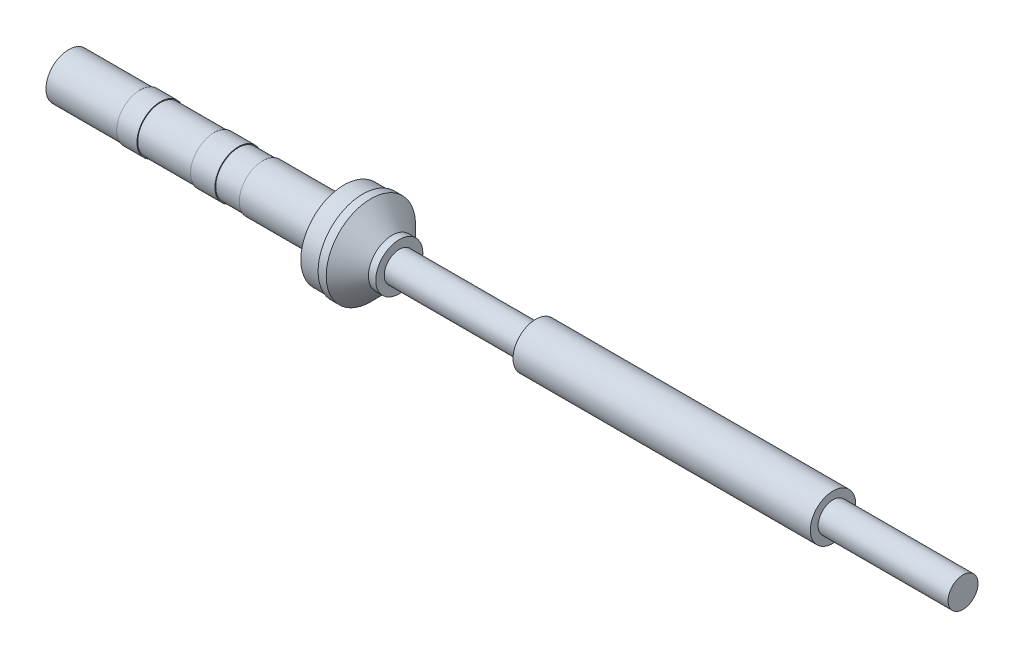
ISO-10303-21;
HEADER;
FILE_DESCRIPTION(('STEP AP214'),'2;1');
FILE_NAME('part.step','',(''),(''),'','','');
FILE_SCHEMA(('AUTOMOTIVE_DESIGN { 1 0 10303 214 1 1 1 1 }'));
ENDSEC;
DATA;
#1=APPLICATION_CONTEXT('core data for automotive mechanical design processes');
#2=APPLICATION_PROTOCOL_DEFINITION('international standard','automotive_design',2000,#1);
#3=PRODUCT_CONTEXT('',#1,'mechanical');
#4=PRODUCT('Part','Part','',(#3));
#5=PRODUCT_RELATED_PRODUCT_CATEGORY('part','',(#4));
#6=PRODUCT_DEFINITION_FORMATION('','',#4);
#7=PRODUCT_DEFINITION_CONTEXT('part definition',#1,'design');
#8=PRODUCT_DEFINITION('design','',#6,#7);
#9=PRODUCT_DEFINITION_SHAPE('','',#8);
#10=(LENGTH_UNIT() NAMED_UNIT(*) SI_UNIT(.MILLI.,.METRE.));
#11=(NAMED_UNIT(*) PLANE_ANGLE_UNIT() SI_UNIT($,.RADIAN.));
#12=(NAMED_UNIT(*) SI_UNIT($,.STERADIAN.) SOLID_ANGLE_UNIT());
#13=UNCERTAINTY_MEASURE_WITH_UNIT(LENGTH_MEASURE(1.E-05),#10,'distance_accuracy_value','');
#14=(GEOMETRIC_REPRESENTATION_CONTEXT(3) GLOBAL_UNCERTAINTY_ASSIGNED_CONTEXT((#13)) GLOBAL_UNIT_ASSIGNED_CONTEXT((#10,
#11,#12)) REPRESENTATION_CONTEXT('',''));
#15=CARTESIAN_POINT('',(0.,0.,0.));
#16=DIRECTION('',(0.,0.,1.));
#17=DIRECTION('',(1.,0.,0.));
#18=AXIS2_PLACEMENT_3D('',#15,#16,#17);
#19=CARTESIAN_POINT('',(28.,0.,0.));
#20=DIRECTION('',(-1.,0.,0.));
#21=DIRECTION('',(0.,0.,1.));
#22=AXIS2_PLACEMENT_3D('',#19,#20,#21);
#23=CYLINDRICAL_SURFACE('',#22,2.79447482898832);
#24=CARTESIAN_POINT('',(28.,0.,0.));
#25=DIRECTION('',(1.,0.,0.));
#26=DIRECTION('',(0.,0.,-1.));
#27=AXIS2_PLACEMENT_3D('',#24,#25,#26);
#28=CIRCLE('',#27,2.79447482898832);
#29=CARTESIAN_POINT('',(28.,0.,-2.79447482898832));
#30=VERTEX_POINT('',#29);
#31=EDGE_CURVE('E11',#30,#30,#28,.T.);
#32=ORIENTED_EDGE('',*,*,#31,.F.);
#33=EDGE_LOOP('',(#32));
#34=FACE_BOUND('',#33,.T.);
#35=CARTESIAN_POINT('',(0.,0.,0.));
#36=DIRECTION('',(1.,0.,0.));
#37=DIRECTION('',(0.,0.,-1.));
#38=AXIS2_PLACEMENT_3D('',#35,#36,#37);
#39=CIRCLE('',#38,2.79447482898832);
#40=CARTESIAN_POINT('',(0.,0.,-2.79447482898832));
#41=VERTEX_POINT('',#40);
#42=EDGE_CURVE('E47',#41,#41,#39,.T.);
#43=ORIENTED_EDGE('',*,*,#42,.T.);
#44=EDGE_LOOP('',(#43));
#45=FACE_BOUND('',#44,.T.);
#46=ADVANCED_FACE('F44',(#34,#45),#23,.T.);
#47=CARTESIAN_POINT('',(28.,0.,0.));
#48=DIRECTION('',(1.,0.,0.));
#49=DIRECTION('',(0.,0.,-1.));
#50=AXIS2_PLACEMENT_3D('',#47,#48,#49);
#51=PLANE('',#50);
#52=ORIENTED_EDGE('',*,*,#31,.T.);
#53=EDGE_LOOP('',(#52));
#54=FACE_BOUND('',#53,.T.);
#55=ADVANCED_FACE('F59',(#54),#51,.T.);
#56=CARTESIAN_POINT('',(0.,0.,0.));
#57=DIRECTION('',(1.,0.,0.));
#58=DIRECTION('',(0.,0.,-1.));
#59=AXIS2_PLACEMENT_3D('',#56,#57,#58);
#60=PLANE('',#59);
#61=ORIENTED_EDGE('',*,*,#42,.F.);
#62=EDGE_LOOP('',(#61));
#63=FACE_BOUND('',#62,.T.);
#64=ADVANCED_FACE('F57',(#63),#60,.F.);
#65=CLOSED_SHELL('',(#46,#55,#64));
#66=MANIFOLD_SOLID_BREP('B2',#65);
#67=CARTESIAN_POINT('',(110.100001096725,0.,1.84592636207639));
#68=DIRECTION('',(1.,0.,0.));
#69=DIRECTION('',(0.,0.,-1.));
#70=AXIS2_PLACEMENT_3D('',#67,#68,#69);
#71=PLANE('',#70);
#72=CARTESIAN_POINT('',(110.100001096725,0.,0.));
#73=DIRECTION('',(-1.,0.,0.));
#74=DIRECTION('',(0.,0.,1.));
#75=AXIS2_PLACEMENT_3D('',#72,#73,#74);
#76=CIRCLE('',#75,1.84592636207639);
#77=CARTESIAN_POINT('',(110.100001096725,0.,1.84592636207639));
#78=VERTEX_POINT('',#77);
#79=EDGE_CURVE('E146',#78,#78,#76,.T.);
#80=ORIENTED_EDGE('',*,*,#79,.F.);
#81=EDGE_LOOP('',(#80));
#82=FACE_BOUND('',#81,.T.);
#83=ADVANCED_FACE('F93',(#82),#71,.T.);
#84=CARTESIAN_POINT('',(0.,0.,0.));
#85=DIRECTION('',(-1.,0.,0.));
#86=DIRECTION('',(0.,0.,1.));
#87=AXIS2_PLACEMENT_3D('',#84,#85,#86);
#88=CYLINDRICAL_SURFACE('',#87,1.84592636207639);
#89=ORIENTED_EDGE('',*,*,#79,.T.);
#90=EDGE_LOOP('',(#89));
#91=FACE_BOUND('',#90,.T.);
#92=CARTESIAN_POINT('',(94.0999984741211,0.,0.));
#93=DIRECTION('',(-1.,0.,0.));
#94=DIRECTION('',(0.,0.,1.));
#95=AXIS2_PLACEMENT_3D('',#92,#93,#94);
#96=CIRCLE('',#95,1.84592636207639);
#97=CARTESIAN_POINT('',(94.0999984741211,0.,1.84592636207639));
#98=VERTEX_POINT('',#97);
#99=EDGE_CURVE('E143',#98,#98,#96,.T.);
#100=ORIENTED_EDGE('',*,*,#99,.F.);
#101=EDGE_LOOP('',(#100));
#102=FACE_BOUND('',#101,.T.);
#103=ADVANCED_FACE('F150',(#91,#102),#88,.T.);
#104=CARTESIAN_POINT('',(94.0999984741211,0.,2.79447482898831));
#105=DIRECTION('',(1.,0.,0.));
#106=DIRECTION('',(0.,0.,-1.));
#107=AXIS2_PLACEMENT_3D('',#104,#105,#106);
#108=PLANE('',#107);
#109=ORIENTED_EDGE('',*,*,#99,.T.);
#110=EDGE_LOOP('',(#109));
#111=FACE_BOUND('',#110,.T.);
#112=CARTESIAN_POINT('',(94.0999984741211,0.,0.));
#113=DIRECTION('',(-1.,0.,0.));
#114=DIRECTION('',(0.,0.,1.));
#115=AXIS2_PLACEMENT_3D('',#112,#113,#114);
#116=CIRCLE('',#115,2.79447482898831);
#117=CARTESIAN_POINT('',(94.0999984741211,0.,2.79447482898831));
#118=VERTEX_POINT('',#117);
#119=EDGE_CURVE('E140',#118,#118,#116,.T.);
#120=ORIENTED_EDGE('',*,*,#119,.F.);
#121=EDGE_LOOP('',(#120));
#122=FACE_BOUND('',#121,.T.);
#123=ADVANCED_FACE('F158',(#111,#122),#108,.T.);
#124=CARTESIAN_POINT('',(0.,0.,0.));
#125=DIRECTION('',(-1.,0.,0.));
#126=DIRECTION('',(0.,0.,1.));
#127=AXIS2_PLACEMENT_3D('',#124,#125,#126);
#128=CYLINDRICAL_SURFACE('',#127,2.79447482898831);
#129=ORIENTED_EDGE('',*,*,#119,.T.);
#130=EDGE_LOOP('',(#129));
#131=FACE_BOUND('',#130,.T.);
#132=CARTESIAN_POINT('',(57.5000010430813,0.,0.));
#133=DIRECTION('',(-1.,0.,0.));
#134=DIRECTION('',(0.,0.,1.));
#135=AXIS2_PLACEMENT_3D('',#132,#133,#134);
#136=CIRCLE('',#135,2.79447482898831);
#137=CARTESIAN_POINT('',(57.5000010430813,0.,2.79447482898831));
#138=VERTEX_POINT('',#137);
#139=EDGE_CURVE('E137',#138,#138,#136,.T.);
#140=ORIENTED_EDGE('',*,*,#139,.F.);
#141=EDGE_LOOP('',(#140));
#142=FACE_BOUND('',#141,.T.);
#143=ADVANCED_FACE('F163',(#131,#142),#128,.T.);
#144=CARTESIAN_POINT('',(57.5000010430813,0.,1.84592636207639));
#145=DIRECTION('',(-1.,0.,0.));
#146=DIRECTION('',(0.,0.,1.));
#147=AXIS2_PLACEMENT_3D('',#144,#145,#146);
#148=PLANE('',#147);
#149=ORIENTED_EDGE('',*,*,#139,.T.);
#150=EDGE_LOOP('',(#149));
#151=FACE_BOUND('',#150,.T.);
#152=CARTESIAN_POINT('',(57.5000010430813,0.,0.));
#153=DIRECTION('',(-1.,0.,0.));
#154=DIRECTION('',(0.,0.,1.));
#155=AXIS2_PLACEMENT_3D('',#152,#153,#154);
#156=CIRCLE('',#155,1.8459263620764);
#157=CARTESIAN_POINT('',(57.5000010430813,0.,1.84592636207639));
#158=VERTEX_POINT('',#157);
#159=EDGE_CURVE('E134',#158,#158,#156,.T.);
#160=ORIENTED_EDGE('',*,*,#159,.F.);
#161=EDGE_LOOP('',(#160));
#162=FACE_BOUND('',#161,.T.);
#163=ADVANCED_FACE('F167',(#151,#162),#148,.T.);
#164=CARTESIAN_POINT('',(0.,0.,0.));
#165=DIRECTION('',(-1.,0.,0.));
#166=DIRECTION('',(0.,0.,1.));
#167=AXIS2_PLACEMENT_3D('',#164,#165,#166);
#168=CYLINDRICAL_SURFACE('',#167,1.8459263620764);
#169=ORIENTED_EDGE('',*,*,#159,.T.);
#170=EDGE_LOOP('',(#169));
#171=FACE_BOUND('',#170,.T.);
#172=CARTESIAN_POINT('',(40.6999997794628,0.,0.));
#173=DIRECTION('',(-1.,0.,0.));
#174=DIRECTION('',(0.,0.,1.));
#175=AXIS2_PLACEMENT_3D('',#172,#173,#174);
#176=CIRCLE('',#175,1.8459263620764);
#177=CARTESIAN_POINT('',(40.6999997794628,0.,1.84592636207639));
#178=VERTEX_POINT('',#177);
#179=EDGE_CURVE('E131',#178,#178,#176,.T.);
#180=ORIENTED_EDGE('',*,*,#179,.F.);
#181=EDGE_LOOP('',(#180));
#182=FACE_BOUND('',#181,.T.);
#183=ADVANCED_FACE('F171',(#171,#182),#168,.T.);
#184=CARTESIAN_POINT('',(40.6999997794628,0.,2.89587310634459));
#185=DIRECTION('',(1.,0.,0.));
#186=DIRECTION('',(0.,0.,-1.));
#187=AXIS2_PLACEMENT_3D('',#184,#185,#186);
#188=PLANE('',#187);
#189=ORIENTED_EDGE('',*,*,#179,.T.);
#190=EDGE_LOOP('',(#189));
#191=FACE_BOUND('',#190,.T.);
#192=CARTESIAN_POINT('',(40.6999997794628,0.,0.));
#193=DIRECTION('',(-1.,0.,0.));
#194=DIRECTION('',(0.,0.,1.));
#195=AXIS2_PLACEMENT_3D('',#192,#193,#194);
#196=CIRCLE('',#195,2.89587310634459);
#197=CARTESIAN_POINT('',(40.6999997794628,0.,2.89587310634459));
#198=VERTEX_POINT('',#197);
#199=EDGE_CURVE('E128',#198,#198,#196,.T.);
#200=ORIENTED_EDGE('',*,*,#199,.F.);
#201=EDGE_LOOP('',(#200));
#202=FACE_BOUND('',#201,.T.);
#203=ADVANCED_FACE('F175',(#191,#202),#188,.T.);
#204=CARTESIAN_POINT('',(0.,0.,0.));
#205=DIRECTION('',(-1.,0.,0.));
#206=DIRECTION('',(0.,0.,1.));
#207=AXIS2_PLACEMENT_3D('',#204,#205,#206);
#208=CYLINDRICAL_SURFACE('',#207,2.89587310634458);
#209=ORIENTED_EDGE('',*,*,#199,.T.);
#210=EDGE_LOOP('',(#209));
#211=FACE_BOUND('',#210,.T.);
#212=CARTESIAN_POINT('',(39.7999994456768,0.,0.));
#213=DIRECTION('',(-1.,0.,0.));
#214=DIRECTION('',(0.,0.,1.));
#215=AXIS2_PLACEMENT_3D('',#212,#213,#214);
#216=CIRCLE('',#215,2.89587310634458);
#217=CARTESIAN_POINT('',(39.7999994456768,0.,2.89587310634458));
#218=VERTEX_POINT('',#217);
#219=EDGE_CURVE('E125',#218,#218,#216,.T.);
#220=ORIENTED_EDGE('',*,*,#219,.F.);
#221=EDGE_LOOP('',(#220));
#222=FACE_BOUND('',#221,.T.);
#223=ADVANCED_FACE('F179',(#211,#222),#208,.T.);
#224=CARTESIAN_POINT('',(37.2000001370907,0.,0.));
#225=DIRECTION('',(-1.,0.,0.));
#226=DIRECTION('',(0.,0.,1.));
#227=AXIS2_PLACEMENT_3D('',#224,#225,#226);
#228=CONICAL_SURFACE('',#227,5.49446186050773,0.785126829263771);
#229=ORIENTED_EDGE('',*,*,#219,.T.);
#230=EDGE_LOOP('',(#229));
#231=FACE_BOUND('',#230,.T.);
#232=CARTESIAN_POINT('',(37.2000001370907,0.,0.));
#233=DIRECTION('',(-1.,0.,0.));
#234=DIRECTION('',(0.,0.,1.));
#235=AXIS2_PLACEMENT_3D('',#232,#233,#234);
#236=CIRCLE('',#235,5.49446186050773);
#237=CARTESIAN_POINT('',(37.2000001370907,0.,5.49446186050773));
#238=VERTEX_POINT('',#237);
#239=EDGE_CURVE('E122',#238,#238,#236,.T.);
#240=ORIENTED_EDGE('',*,*,#239,.F.);
#241=EDGE_LOOP('',(#240));
#242=FACE_BOUND('',#241,.T.);
#243=ADVANCED_FACE('F183',(#231,#242),#228,.T.);
#244=CARTESIAN_POINT('',(0.,0.,0.));
#245=DIRECTION('',(-1.,0.,0.));
#246=DIRECTION('',(0.,0.,1.));
#247=AXIS2_PLACEMENT_3D('',#244,#245,#246);
#248=CYLINDRICAL_SURFACE('',#247,5.49446186050773);
#249=ORIENTED_EDGE('',*,*,#239,.T.);
#250=EDGE_LOOP('',(#249));
#251=FACE_BOUND('',#250,.T.);
#252=CARTESIAN_POINT('',(36.2000018358231,0.,0.));
#253=DIRECTION('',(-1.,0.,0.));
#254=DIRECTION('',(0.,0.,1.));
#255=AXIS2_PLACEMENT_3D('',#252,#253,#254);
#256=CIRCLE('',#255,5.49446186050773);
#257=CARTESIAN_POINT('',(36.2000018358231,0.,5.49446186050773));
#258=VERTEX_POINT('',#257);
#259=EDGE_CURVE('E119',#258,#258,#256,.T.);
#260=ORIENTED_EDGE('',*,*,#259,.F.);
#261=EDGE_LOOP('',(#260));
#262=FACE_BOUND('',#261,.T.);
#263=ADVANCED_FACE('F187',(#251,#262),#248,.T.);
#264=CARTESIAN_POINT('',(36.2000018358231,0.,5.32086050421316));
#265=DIRECTION('',(-1.,0.,0.));
#266=DIRECTION('',(0.,0.,1.));
#267=AXIS2_PLACEMENT_3D('',#264,#265,#266);
#268=PLANE('',#267);
#269=ORIENTED_EDGE('',*,*,#259,.T.);
#270=EDGE_LOOP('',(#269));
#271=FACE_BOUND('',#270,.T.);
#272=CARTESIAN_POINT('',(36.2000018358231,0.,0.));
#273=DIRECTION('',(-1.,0.,0.));
#274=DIRECTION('',(0.,0.,1.));
#275=AXIS2_PLACEMENT_3D('',#272,#273,#274);
#276=CIRCLE('',#275,5.32086050421316);
#277=CARTESIAN_POINT('',(36.2000018358231,0.,5.32086050421316));
#278=VERTEX_POINT('',#277);
#279=EDGE_CURVE('E116',#278,#278,#276,.T.);
#280=ORIENTED_EDGE('',*,*,#279,.F.);
#281=EDGE_LOOP('',(#280));
#282=FACE_BOUND('',#281,.T.);
#283=ADVANCED_FACE('F191',(#271,#282),#268,.T.);
#284=CARTESIAN_POINT('',(0.,0.,0.));
#285=DIRECTION('',(-1.,0.,0.));
#286=DIRECTION('',(0.,0.,1.));
#287=AXIS2_PLACEMENT_3D('',#284,#285,#286);
#288=CYLINDRICAL_SURFACE('',#287,5.32086050421316);
#289=ORIENTED_EDGE('',*,*,#279,.T.);
#290=EDGE_LOOP('',(#289));
#291=FACE_BOUND('',#290,.T.);
#292=CARTESIAN_POINT('',(33.9000001549721,0.,0.));
#293=DIRECTION('',(-1.,0.,0.));
#294=DIRECTION('',(0.,0.,1.));
#295=AXIS2_PLACEMENT_3D('',#292,#293,#294);
#296=CIRCLE('',#295,5.32086050421316);
#297=CARTESIAN_POINT('',(33.9000001549721,0.,5.32086050421316));
#298=VERTEX_POINT('',#297);
#299=EDGE_CURVE('E113',#298,#298,#296,.T.);
#300=ORIENTED_EDGE('',*,*,#299,.F.);
#301=EDGE_LOOP('',(#300));
#302=FACE_BOUND('',#301,.T.);
#303=ADVANCED_FACE('F195',(#291,#302),#288,.T.);
#304=CARTESIAN_POINT('',(33.9000001549721,0.,2.89587310634459));
#305=DIRECTION('',(-1.,0.,0.));
#306=DIRECTION('',(0.,0.,1.));
#307=AXIS2_PLACEMENT_3D('',#304,#305,#306);
#308=PLANE('',#307);
#309=ORIENTED_EDGE('',*,*,#299,.T.);
#310=EDGE_LOOP('',(#309));
#311=FACE_BOUND('',#310,.T.);
#312=CARTESIAN_POINT('',(33.9000001549721,0.,0.));
#313=DIRECTION('',(-1.,0.,0.));
#314=DIRECTION('',(0.,0.,1.));
#315=AXIS2_PLACEMENT_3D('',#312,#313,#314);
#316=CIRCLE('',#315,2.89587310634459);
#317=CARTESIAN_POINT('',(33.9000001549721,0.,2.89587310634459));
#318=VERTEX_POINT('',#317);
#319=EDGE_CURVE('E108',#318,#318,#316,.T.);
#320=ORIENTED_EDGE('',*,*,#319,.F.);
#321=EDGE_LOOP('',(#320));
#322=FACE_BOUND('',#321,.T.);
#323=ADVANCED_FACE('F199',(#311,#322),#308,.T.);
#324=CARTESIAN_POINT('',(0.,0.,0.));
#325=DIRECTION('',(-1.,0.,0.));
#326=DIRECTION('',(0.,0.,1.));
#327=AXIS2_PLACEMENT_3D('',#324,#325,#326);
#328=CYLINDRICAL_SURFACE('',#327,2.89587310634459);
#329=ORIENTED_EDGE('',*,*,#319,.T.);
#330=EDGE_LOOP('',(#329));
#331=FACE_BOUND('',#330,.T.);
#332=CARTESIAN_POINT('',(23.9000003784895,0.,0.));
#333=DIRECTION('',(-1.,0.,0.));
#334=DIRECTION('',(0.,0.,1.));
#335=AXIS2_PLACEMENT_3D('',#332,#333,#334);
#336=CIRCLE('',#335,2.89587310634459);
#337=CARTESIAN_POINT('',(23.9000003784895,0.,2.89587310634459));
#338=VERTEX_POINT('',#337);
#339=EDGE_CURVE('E104',#338,#338,#336,.T.);
#340=ORIENTED_EDGE('',*,*,#339,.F.);
#341=EDGE_LOOP('',(#340));
#342=FACE_BOUND('',#341,.T.);
#343=ADVANCED_FACE('F203',(#331,#342),#328,.T.);
#344=CARTESIAN_POINT('',(23.9000003784895,0.,2.89587310634459));
#345=DIRECTION('',(-1.,0.,0.));
#346=DIRECTION('',(0.,0.,1.));
#347=AXIS2_PLACEMENT_3D('',#344,#345,#346);
#348=PLANE('',#347);
#349=ORIENTED_EDGE('',*,*,#339,.T.);
#350=EDGE_LOOP('',(#349));
#351=FACE_BOUND('',#350,.T.);
#352=CARTESIAN_POINT('',(23.9000003784895,0.,0.));
#353=DIRECTION('',(-1.,0.,0.));
#354=DIRECTION('',(0.,0.,1.));
#355=AXIS2_PLACEMENT_3D('',#352,#353,#354);
#356=CIRCLE('',#355,2.79447482898832);
#357=CARTESIAN_POINT('',(23.9000003784895,0.,2.79447482898831));
#358=VERTEX_POINT('',#357);
#359=EDGE_CURVE('E100',#358,#358,#356,.T.);
#360=ORIENTED_EDGE('',*,*,#359,.F.);
#361=EDGE_LOOP('',(#360));
#362=FACE_BOUND('',#361,.T.);
#363=ADVANCED_FACE('F207',(#351,#362),#348,.T.);
#364=CARTESIAN_POINT('',(28.,0.,0.));
#365=DIRECTION('',(-1.,0.,0.));
#366=DIRECTION('',(0.,0.,1.));
#367=AXIS2_PLACEMENT_3D('',#364,#365,#366);
#368=CYLINDRICAL_SURFACE('',#367,2.79447482898832);
#369=ORIENTED_EDGE('',*,*,#359,.T.);
#370=EDGE_LOOP('',(#369));
#371=FACE_BOUND('',#370,.T.);
#372=CARTESIAN_POINT('',(28.,0.,0.));
#373=DIRECTION('',(-1.,0.,0.));
#374=DIRECTION('',(0.,0.,1.));
#375=AXIS2_PLACEMENT_3D('',#372,#373,#374);
#376=CIRCLE('',#375,2.79447482898832);
#377=CARTESIAN_POINT('',(28.,0.,2.79447482898831));
#378=VERTEX_POINT('',#377);
#379=EDGE_CURVE('E43',#378,#378,#376,.T.);
#380=ORIENTED_EDGE('',*,*,#379,.F.);
#381=EDGE_LOOP('',(#380));
#382=FACE_BOUND('',#381,.T.);
#383=ADVANCED_FACE('F95',(#371,#382),#368,.F.);
#384=CARTESIAN_POINT('',(28.,0.,0.));
#385=DIRECTION('',(-1.,0.,0.));
#386=DIRECTION('',(0.,0.,1.));
#387=AXIS2_PLACEMENT_3D('',#384,#385,#386);
#388=PLANE('',#387);
#389=ORIENTED_EDGE('',*,*,#379,.T.);
#390=EDGE_LOOP('',(#389));
#391=FACE_BOUND('',#390,.T.);
#392=ADVANCED_FACE('F211',(#391),#388,.T.);
#393=CLOSED_SHELL('',(#83,#103,#123,#143,#163,#183,#203,#223,#243,#263,#283,#303,#323,#343,#363,
#383,#392));
#394=MANIFOLD_SOLID_BREP('B6',#393);
#395=CARTESIAN_POINT('',(11.3000003620982,0.,2.89587310634459));
#396=DIRECTION('',(1.,0.,0.));
#397=DIRECTION('',(0.,0.,-1.));
#398=AXIS2_PLACEMENT_3D('',#395,#396,#397);
#399=PLANE('',#398);
#400=CARTESIAN_POINT('',(11.3000003620982,0.,0.));
#401=DIRECTION('',(1.,0.,0.));
#402=DIRECTION('',(0.,0.,-1.));
#403=AXIS2_PLACEMENT_3D('',#400,#401,#402);
#404=CIRCLE('',#403,2.79447482898832);
#405=CARTESIAN_POINT('',(11.3000003620982,0.,-2.79447482898832));
#406=VERTEX_POINT('',#405);
#407=EDGE_CURVE('E358',#406,#406,#404,.T.);
#408=ORIENTED_EDGE('',*,*,#407,.F.);
#409=EDGE_LOOP('',(#408));
#410=FACE_BOUND('',#409,.T.);
#411=CARTESIAN_POINT('',(11.3000003620982,0.,0.));
#412=DIRECTION('',(-1.,0.,0.));
#413=DIRECTION('',(0.,0.,1.));
#414=AXIS2_PLACEMENT_3D('',#411,#412,#413);
#415=CIRCLE('',#414,2.89587310634459);
#416=CARTESIAN_POINT('',(11.3000003620982,0.,2.89587310634459));
#417=VERTEX_POINT('',#416);
#418=EDGE_CURVE('E366',#417,#417,#415,.T.);
#419=ORIENTED_EDGE('',*,*,#418,.F.);
#420=EDGE_LOOP('',(#419));
#421=FACE_BOUND('',#420,.T.);
#422=ADVANCED_FACE('F351',(#410,#421),#399,.T.);
#423=CARTESIAN_POINT('',(0.,0.,0.));
#424=DIRECTION('',(-1.,0.,0.));
#425=DIRECTION('',(0.,0.,1.));
#426=AXIS2_PLACEMENT_3D('',#423,#424,#425);
#427=CYLINDRICAL_SURFACE('',#426,2.89587310634459);
#428=ORIENTED_EDGE('',*,*,#418,.T.);
#429=EDGE_LOOP('',(#428));
#430=FACE_BOUND('',#429,.T.);
#431=CARTESIAN_POINT('',(8.79999995231628,0.,0.));
#432=DIRECTION('',(-1.,0.,0.));
#433=DIRECTION('',(0.,0.,1.));
#434=AXIS2_PLACEMENT_3D('',#431,#432,#433);
#435=CIRCLE('',#434,2.89587310634459);
#436=CARTESIAN_POINT('',(8.79999995231628,0.,2.89587310634459));
#437=VERTEX_POINT('',#436);
#438=EDGE_CURVE('E362',#437,#437,#435,.T.);
#439=ORIENTED_EDGE('',*,*,#438,.F.);
#440=EDGE_LOOP('',(#439));
#441=FACE_BOUND('',#440,.T.);
#442=ADVANCED_FACE('F372',(#430,#441),#427,.T.);
#443=CARTESIAN_POINT('',(8.79999995231628,0.,2.89587310634459));
#444=DIRECTION('',(-1.,0.,0.));
#445=DIRECTION('',(0.,0.,1.));
#446=AXIS2_PLACEMENT_3D('',#443,#444,#445);
#447=PLANE('',#446);
#448=ORIENTED_EDGE('',*,*,#438,.T.);
#449=EDGE_LOOP('',(#448));
#450=FACE_BOUND('',#449,.T.);
#451=CARTESIAN_POINT('',(8.79999995231628,0.,0.));
#452=DIRECTION('',(-1.,0.,0.));
#453=DIRECTION('',(0.,0.,1.));
#454=AXIS2_PLACEMENT_3D('',#451,#452,#453);
#455=CIRCLE('',#454,2.79447482898832);
#456=CARTESIAN_POINT('',(8.79999995231628,0.,2.79447482898831));
#457=VERTEX_POINT('',#456);
#458=EDGE_CURVE('E92',#457,#457,#455,.T.);
#459=ORIENTED_EDGE('',*,*,#458,.F.);
#460=EDGE_LOOP('',(#459));
#461=FACE_BOUND('',#460,.T.);
#462=ADVANCED_FACE('F381',(#450,#461),#447,.T.);
#463=CARTESIAN_POINT('',(28.,0.,0.));
#464=DIRECTION('',(-1.,0.,0.));
#465=DIRECTION('',(0.,0.,1.));
#466=AXIS2_PLACEMENT_3D('',#463,#464,#465);
#467=CYLINDRICAL_SURFACE('',#466,2.79447482898832);
#468=ORIENTED_EDGE('',*,*,#407,.T.);
#469=EDGE_LOOP('',(#468));
#470=FACE_BOUND('',#469,.T.);
#471=ORIENTED_EDGE('',*,*,#458,.T.);
#472=EDGE_LOOP('',(#471));
#473=FACE_BOUND('',#472,.T.);
#474=ADVANCED_FACE('F353',(#470,#473),#467,.F.);
#475=CLOSED_SHELL('',(#422,#442,#462,#474));
#476=MANIFOLD_SOLID_BREP('B38',#475);
#477=CARTESIAN_POINT('',(20.8999998867512,0.,2.89587310634459));
#478=DIRECTION('',(1.,0.,0.));
#479=DIRECTION('',(0.,0.,-1.));
#480=AXIS2_PLACEMENT_3D('',#477,#478,#479);
#481=PLANE('',#480);
#482=CARTESIAN_POINT('',(20.8999998867512,0.,0.));
#483=DIRECTION('',(1.,0.,0.));
#484=DIRECTION('',(0.,0.,-1.));
#485=AXIS2_PLACEMENT_3D('',#482,#483,#484);
#486=CIRCLE('',#485,2.79447482898832);
#487=CARTESIAN_POINT('',(20.8999998867512,0.,-2.79447482898832));
#488=VERTEX_POINT('',#487);
#489=EDGE_CURVE('E423',#488,#488,#486,.T.);
#490=ORIENTED_EDGE('',*,*,#489,.F.);
#491=EDGE_LOOP('',(#490));
#492=FACE_BOUND('',#491,.T.);
#493=CARTESIAN_POINT('',(20.8999998867512,0.,0.));
#494=DIRECTION('',(-1.,0.,0.));
#495=DIRECTION('',(0.,0.,1.));
#496=AXIS2_PLACEMENT_3D('',#493,#494,#495);
#497=CIRCLE('',#496,2.89587310634459);
#498=CARTESIAN_POINT('',(20.8999998867512,0.,2.89587310634459));
#499=VERTEX_POINT('',#498);
#500=EDGE_CURVE('E350',#499,#499,#497,.T.);
#501=ORIENTED_EDGE('',*,*,#500,.F.);
#502=EDGE_LOOP('',(#501));
#503=FACE_BOUND('',#502,.T.);
#504=ADVANCED_FACE('F413',(#492,#503),#481,.T.);
#505=CARTESIAN_POINT('',(0.,0.,0.));
#506=DIRECTION('',(-1.,0.,0.));
#507=DIRECTION('',(0.,0.,1.));
#508=AXIS2_PLACEMENT_3D('',#505,#506,#507);
#509=CYLINDRICAL_SURFACE('',#508,2.89587310634459);
#510=ORIENTED_EDGE('',*,*,#500,.T.);
#511=EDGE_LOOP('',(#510));
#512=FACE_BOUND('',#511,.T.);
#513=CARTESIAN_POINT('',(17.8999993950129,0.,0.));
#514=DIRECTION('',(-1.,0.,0.));
#515=DIRECTION('',(0.,0.,1.));
#516=AXIS2_PLACEMENT_3D('',#513,#514,#515);
#517=CIRCLE('',#516,2.89587310634459);
#518=CARTESIAN_POINT('',(17.8999993950129,0.,2.89587310634459));
#519=VERTEX_POINT('',#518);
#520=EDGE_CURVE('E419',#519,#519,#517,.T.);
#521=ORIENTED_EDGE('',*,*,#520,.F.);
#522=EDGE_LOOP('',(#521));
#523=FACE_BOUND('',#522,.T.);
#524=ADVANCED_FACE('F437',(#512,#523),#509,.T.);
#525=CARTESIAN_POINT('',(17.8999993950129,0.,2.89587310634459));
#526=DIRECTION('',(-1.,0.,0.));
#527=DIRECTION('',(0.,0.,1.));
#528=AXIS2_PLACEMENT_3D('',#525,#526,#527);
#529=PLANE('',#528);
#530=ORIENTED_EDGE('',*,*,#520,.T.);
#531=EDGE_LOOP('',(#530));
#532=FACE_BOUND('',#531,.T.);
#533=CARTESIAN_POINT('',(17.8999993950129,0.,0.));
#534=DIRECTION('',(-1.,0.,0.));
#535=DIRECTION('',(0.,0.,1.));
#536=AXIS2_PLACEMENT_3D('',#533,#534,#535);
#537=CIRCLE('',#536,2.79447482898832);
#538=CARTESIAN_POINT('',(17.8999993950129,0.,2.79447482898831));
#539=VERTEX_POINT('',#538);
#540=EDGE_CURVE('E427',#539,#539,#537,.T.);
#541=ORIENTED_EDGE('',*,*,#540,.F.);
#542=EDGE_LOOP('',(#541));
#543=FACE_BOUND('',#542,.T.);
#544=ADVANCED_FACE('F435',(#532,#543),#529,.T.);
#545=CARTESIAN_POINT('',(28.,0.,0.));
#546=DIRECTION('',(-1.,0.,0.));
#547=DIRECTION('',(0.,0.,1.));
#548=AXIS2_PLACEMENT_3D('',#545,#546,#547);
#549=CYLINDRICAL_SURFACE('',#548,2.79447482898832);
#550=ORIENTED_EDGE('',*,*,#489,.T.);
#551=EDGE_LOOP('',(#550));
#552=FACE_BOUND('',#551,.T.);
#553=ORIENTED_EDGE('',*,*,#540,.T.);
#554=EDGE_LOOP('',(#553));
#555=FACE_BOUND('',#554,.T.);
#556=ADVANCED_FACE('F433',(#552,#555),#549,.F.);
#557=CLOSED_SHELL('',(#504,#524,#544,#556));
#558=MANIFOLD_SOLID_BREP('B87',#557);
#559=ADVANCED_BREP_SHAPE_REPRESENTATION('',(#18,#66,#394,#476,#558),#14);
#560=SHAPE_DEFINITION_REPRESENTATION(#9,#559);
ENDSEC;
END-ISO-10303-21;
